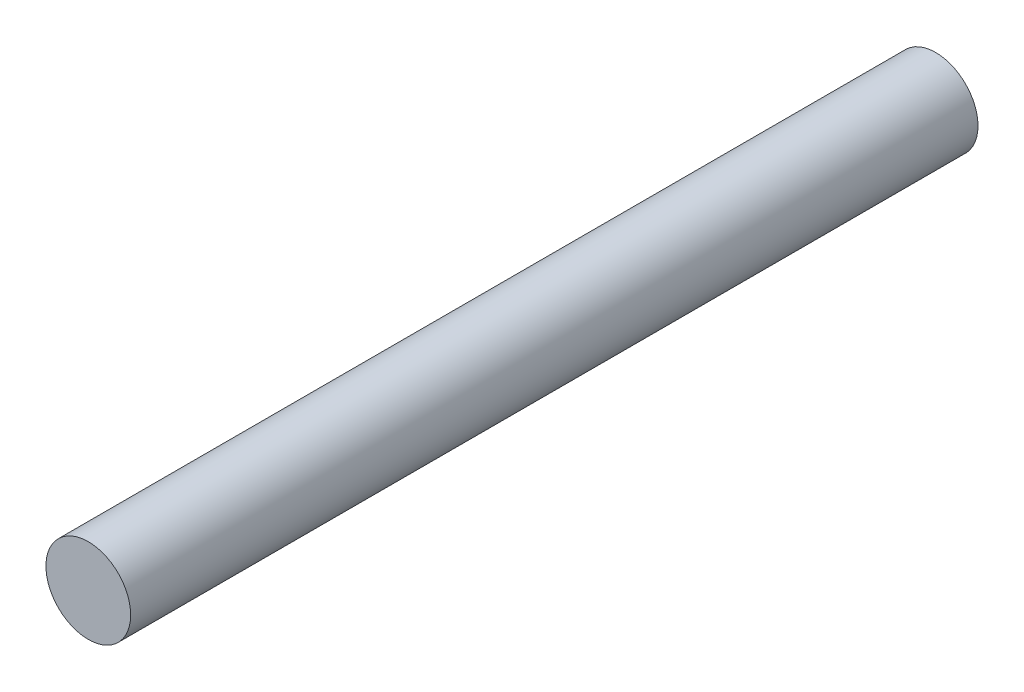
ISO-10303-21;
HEADER;
FILE_DESCRIPTION(('STEP AP214'),'2;1');
FILE_NAME('part.step','',(''),(''),'','','');
FILE_SCHEMA(('AUTOMOTIVE_DESIGN { 1 0 10303 214 1 1 1 1 }'));
ENDSEC;
DATA;
#1=APPLICATION_CONTEXT('core data for automotive mechanical design processes');
#2=APPLICATION_PROTOCOL_DEFINITION('international standard','automotive_design',2000,#1);
#3=PRODUCT_CONTEXT('',#1,'mechanical');
#4=PRODUCT('Part','Part','',(#3));
#5=PRODUCT_RELATED_PRODUCT_CATEGORY('part','',(#4));
#6=PRODUCT_DEFINITION_FORMATION('','',#4);
#7=PRODUCT_DEFINITION_CONTEXT('part definition',#1,'design');
#8=PRODUCT_DEFINITION('design','',#6,#7);
#9=PRODUCT_DEFINITION_SHAPE('','',#8);
#10=(LENGTH_UNIT() NAMED_UNIT(*) SI_UNIT(.MILLI.,.METRE.));
#11=(NAMED_UNIT(*) PLANE_ANGLE_UNIT() SI_UNIT($,.RADIAN.));
#12=(NAMED_UNIT(*) SI_UNIT($,.STERADIAN.) SOLID_ANGLE_UNIT());
#13=UNCERTAINTY_MEASURE_WITH_UNIT(LENGTH_MEASURE(1.E-05),#10,'distance_accuracy_value','');
#14=(GEOMETRIC_REPRESENTATION_CONTEXT(3) GLOBAL_UNCERTAINTY_ASSIGNED_CONTEXT((#13)) GLOBAL_UNIT_ASSIGNED_CONTEXT((#10,
#11,#12)) REPRESENTATION_CONTEXT('',''));
#15=CARTESIAN_POINT('',(0.,0.,0.));
#16=DIRECTION('',(0.,0.,1.));
#17=DIRECTION('',(1.,0.,0.));
#18=AXIS2_PLACEMENT_3D('',#15,#16,#17);
#19=CARTESIAN_POINT('',(0.,0.,12.));
#20=DIRECTION('',(0.,0.,-1.));
#21=DIRECTION('',(-1.,0.,0.));
#22=AXIS2_PLACEMENT_3D('',#19,#20,#21);
#23=CYLINDRICAL_SURFACE('',#22,0.6);
#24=CARTESIAN_POINT('',(0.,0.,12.));
#25=DIRECTION('',(0.,0.,1.));
#26=DIRECTION('',(1.,0.,0.));
#27=AXIS2_PLACEMENT_3D('',#24,#25,#26);
#28=CIRCLE('',#27,0.6);
#29=CARTESIAN_POINT('',(0.6,0.,12.));
#30=VERTEX_POINT('',#29);
#31=EDGE_CURVE('E10',#30,#30,#28,.T.);
#32=ORIENTED_EDGE('',*,*,#31,.F.);
#33=EDGE_LOOP('',(#32));
#34=FACE_BOUND('',#33,.T.);
#35=CARTESIAN_POINT('',(0.,0.,0.));
#36=DIRECTION('',(0.,0.,1.));
#37=DIRECTION('',(1.,0.,0.));
#38=AXIS2_PLACEMENT_3D('',#35,#36,#37);
#39=CIRCLE('',#38,0.6);
#40=CARTESIAN_POINT('',(0.6,0.,0.));
#41=VERTEX_POINT('',#40);
#42=EDGE_CURVE('E38',#41,#41,#39,.T.);
#43=ORIENTED_EDGE('',*,*,#42,.T.);
#44=EDGE_LOOP('',(#43));
#45=FACE_BOUND('',#44,.T.);
#46=ADVANCED_FACE('F35',(#34,#45),#23,.T.);
#47=CARTESIAN_POINT('',(0.,0.,12.));
#48=DIRECTION('',(0.,0.,1.));
#49=DIRECTION('',(1.,0.,0.));
#50=AXIS2_PLACEMENT_3D('',#47,#48,#49);
#51=PLANE('',#50);
#52=ORIENTED_EDGE('',*,*,#31,.T.);
#53=EDGE_LOOP('',(#52));
#54=FACE_BOUND('',#53,.T.);
#55=ADVANCED_FACE('F50',(#54),#51,.T.);
#56=CARTESIAN_POINT('',(0.,0.,0.));
#57=DIRECTION('',(0.,0.,1.));
#58=DIRECTION('',(1.,0.,0.));
#59=AXIS2_PLACEMENT_3D('',#56,#57,#58);
#60=PLANE('',#59);
#61=ORIENTED_EDGE('',*,*,#42,.F.);
#62=EDGE_LOOP('',(#61));
#63=FACE_BOUND('',#62,.T.);
#64=ADVANCED_FACE('F48',(#63),#60,.F.);
#65=CLOSED_SHELL('',(#46,#55,#64));
#66=MANIFOLD_SOLID_BREP('B2',#65);
#67=ADVANCED_BREP_SHAPE_REPRESENTATION('',(#18,#66),#14);
#68=SHAPE_DEFINITION_REPRESENTATION(#9,#67);
ENDSEC;
END-ISO-10303-21;
